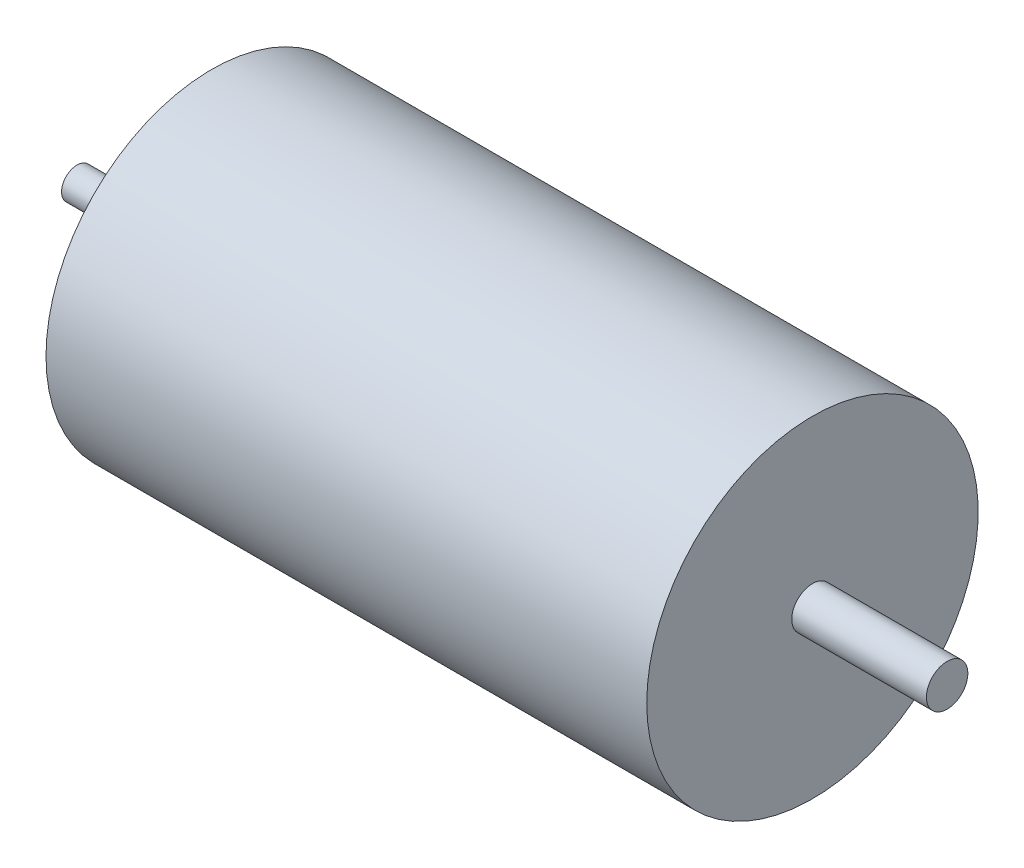
ISO-10303-21;
HEADER;
FILE_DESCRIPTION(('STEP AP214'),'2;1');
FILE_NAME('part.step','',(''),(''),'','','');
FILE_SCHEMA(('AUTOMOTIVE_DESIGN { 1 0 10303 214 1 1 1 1 }'));
ENDSEC;
DATA;
#1=APPLICATION_CONTEXT('core data for automotive mechanical design processes');
#2=APPLICATION_PROTOCOL_DEFINITION('international standard','automotive_design',2000,#1);
#3=PRODUCT_CONTEXT('',#1,'mechanical');
#4=PRODUCT('Part','Part','',(#3));
#5=PRODUCT_RELATED_PRODUCT_CATEGORY('part','',(#4));
#6=PRODUCT_DEFINITION_FORMATION('','',#4);
#7=PRODUCT_DEFINITION_CONTEXT('part definition',#1,'design');
#8=PRODUCT_DEFINITION('design','',#6,#7);
#9=PRODUCT_DEFINITION_SHAPE('','',#8);
#10=(LENGTH_UNIT() NAMED_UNIT(*) SI_UNIT(.MILLI.,.METRE.));
#11=(NAMED_UNIT(*) PLANE_ANGLE_UNIT() SI_UNIT($,.RADIAN.));
#12=(NAMED_UNIT(*) SI_UNIT($,.STERADIAN.) SOLID_ANGLE_UNIT());
#13=UNCERTAINTY_MEASURE_WITH_UNIT(LENGTH_MEASURE(1.E-05),#10,'distance_accuracy_value','');
#14=(GEOMETRIC_REPRESENTATION_CONTEXT(3) GLOBAL_UNCERTAINTY_ASSIGNED_CONTEXT((#13)) GLOBAL_UNIT_ASSIGNED_CONTEXT((#10,
#11,#12)) REPRESENTATION_CONTEXT('',''));
#15=CARTESIAN_POINT('',(0.,0.,0.));
#16=DIRECTION('',(0.,0.,1.));
#17=DIRECTION('',(1.,0.,0.));
#18=AXIS2_PLACEMENT_3D('',#15,#16,#17);
#19=CARTESIAN_POINT('',(0.,6.5,0.));
#20=DIRECTION('',(1.,0.,0.));
#21=DIRECTION('',(0.,0.,-1.));
#22=AXIS2_PLACEMENT_3D('',#19,#20,#21);
#23=PLANE('',#22);
#24=CARTESIAN_POINT('',(0.,9.5,0.));
#25=DIRECTION('',(-1.,0.,0.));
#26=DIRECTION('',(0.,0.,1.));
#27=AXIS2_PLACEMENT_3D('',#24,#25,#26);
#28=CIRCLE('',#27,1.275);
#29=CARTESIAN_POINT('',(0.,9.5,1.275));
#30=VERTEX_POINT('',#29);
#31=EDGE_CURVE('E90',#30,#30,#28,.T.);
#32=ORIENTED_EDGE('',*,*,#31,.F.);
#33=EDGE_LOOP('',(#32));
#34=FACE_BOUND('',#33,.T.);
#35=CARTESIAN_POINT('',(0.,-4.75,-8.22724133595217));
#36=DIRECTION('',(-1.,0.,0.));
#37=DIRECTION('',(0.,0.,1.));
#38=AXIS2_PLACEMENT_3D('',#35,#36,#37);
#39=CIRCLE('',#38,1.275);
#40=CARTESIAN_POINT('',(0.,-4.75,-6.95224133595216));
#41=VERTEX_POINT('',#40);
#42=EDGE_CURVE('E83',#41,#41,#39,.T.);
#43=ORIENTED_EDGE('',*,*,#42,.F.);
#44=EDGE_LOOP('',(#43));
#45=FACE_BOUND('',#44,.T.);
#46=CARTESIAN_POINT('',(0.,-4.75,8.22724133595217));
#47=DIRECTION('',(-1.,0.,0.));
#48=DIRECTION('',(0.,0.,1.));
#49=AXIS2_PLACEMENT_3D('',#46,#47,#48);
#50=CIRCLE('',#49,1.275);
#51=CARTESIAN_POINT('',(0.,-4.75,9.50224133595217));
#52=VERTEX_POINT('',#51);
#53=EDGE_CURVE('E99',#52,#52,#50,.T.);
#54=ORIENTED_EDGE('',*,*,#53,.F.);
#55=EDGE_LOOP('',(#54));
#56=FACE_BOUND('',#55,.T.);
#57=CARTESIAN_POINT('',(0.,-9.5,0.));
#58=DIRECTION('',(-1.,0.,0.));
#59=DIRECTION('',(0.,0.,1.));
#60=AXIS2_PLACEMENT_3D('',#57,#58,#59);
#61=CIRCLE('',#60,1.275);
#62=CARTESIAN_POINT('',(0.,-9.5,1.275));
#63=VERTEX_POINT('',#62);
#64=EDGE_CURVE('E108',#63,#63,#61,.T.);
#65=ORIENTED_EDGE('',*,*,#64,.F.);
#66=EDGE_LOOP('',(#65));
#67=FACE_BOUND('',#66,.T.);
#68=CARTESIAN_POINT('',(0.,0.,0.));
#69=DIRECTION('',(-1.,0.,0.));
#70=DIRECTION('',(0.,0.,1.));
#71=AXIS2_PLACEMENT_3D('',#68,#69,#70);
#72=CIRCLE('',#71,6.5);
#73=CARTESIAN_POINT('',(0.,0.,6.5));
#74=VERTEX_POINT('',#73);
#75=EDGE_CURVE('E117',#74,#74,#72,.T.);
#76=ORIENTED_EDGE('',*,*,#75,.F.);
#77=EDGE_LOOP('',(#76));
#78=FACE_BOUND('',#77,.T.);
#79=CARTESIAN_POINT('',(0.,0.,0.));
#80=DIRECTION('',(-1.,0.,0.));
#81=DIRECTION('',(0.,0.,1.));
#82=AXIS2_PLACEMENT_3D('',#79,#80,#81);
#83=CIRCLE('',#82,16.);
#84=CARTESIAN_POINT('',(0.,0.,16.));
#85=VERTEX_POINT('',#84);
#86=EDGE_CURVE('E13',#85,#85,#83,.T.);
#87=ORIENTED_EDGE('',*,*,#86,.T.);
#88=EDGE_LOOP('',(#87));
#89=FACE_BOUND('',#88,.T.);
#90=ADVANCED_FACE('F53',(#34,#45,#56,#67,#78,#89),#23,.F.);
#91=CARTESIAN_POINT('',(-42.4703832752613,0.,0.));
#92=DIRECTION('',(-1.,0.,0.));
#93=DIRECTION('',(0.,0.,1.));
#94=AXIS2_PLACEMENT_3D('',#91,#92,#93);
#95=CYLINDRICAL_SURFACE('',#94,16.);
#96=ORIENTED_EDGE('',*,*,#86,.F.);
#97=EDGE_LOOP('',(#96));
#98=FACE_BOUND('',#97,.T.);
#99=CARTESIAN_POINT('',(58.,0.,0.));
#100=DIRECTION('',(-1.,0.,0.));
#101=DIRECTION('',(0.,0.,1.));
#102=AXIS2_PLACEMENT_3D('',#99,#100,#101);
#103=CIRCLE('',#102,16.);
#104=CARTESIAN_POINT('',(58.,0.,16.));
#105=VERTEX_POINT('',#104);
#106=EDGE_CURVE('E60',#105,#105,#103,.T.);
#107=ORIENTED_EDGE('',*,*,#106,.T.);
#108=EDGE_LOOP('',(#107));
#109=FACE_BOUND('',#108,.T.);
#110=ADVANCED_FACE('F137',(#98,#109),#95,.T.);
#111=CARTESIAN_POINT('',(58.,16.,0.));
#112=DIRECTION('',(-1.,0.,0.));
#113=DIRECTION('',(0.,0.,1.));
#114=AXIS2_PLACEMENT_3D('',#111,#112,#113);
#115=PLANE('',#114);
#116=ORIENTED_EDGE('',*,*,#106,.F.);
#117=EDGE_LOOP('',(#116));
#118=FACE_BOUND('',#117,.T.);
#119=CARTESIAN_POINT('',(58.,0.,0.));
#120=DIRECTION('',(-1.,0.,0.));
#121=DIRECTION('',(0.,0.,1.));
#122=AXIS2_PLACEMENT_3D('',#119,#120,#121);
#123=CIRCLE('',#122,2.);
#124=CARTESIAN_POINT('',(58.,0.,2.));
#125=VERTEX_POINT('',#124);
#126=EDGE_CURVE('E132',#125,#125,#123,.T.);
#127=ORIENTED_EDGE('',*,*,#126,.T.);
#128=EDGE_LOOP('',(#127));
#129=FACE_BOUND('',#128,.T.);
#130=ADVANCED_FACE('F139',(#118,#129),#115,.F.);
#131=CARTESIAN_POINT('',(-42.4703832752613,0.,0.));
#132=DIRECTION('',(-1.,0.,0.));
#133=DIRECTION('',(0.,0.,1.));
#134=AXIS2_PLACEMENT_3D('',#131,#132,#133);
#135=CYLINDRICAL_SURFACE('',#134,2.);
#136=ORIENTED_EDGE('',*,*,#126,.F.);
#137=EDGE_LOOP('',(#136));
#138=FACE_BOUND('',#137,.T.);
#139=CARTESIAN_POINT('',(71.,0.,0.));
#140=DIRECTION('',(-1.,0.,0.));
#141=DIRECTION('',(0.,0.,1.));
#142=AXIS2_PLACEMENT_3D('',#139,#140,#141);
#143=CIRCLE('',#142,2.);
#144=CARTESIAN_POINT('',(71.,0.,2.));
#145=VERTEX_POINT('',#144);
#146=EDGE_CURVE('E129',#145,#145,#143,.T.);
#147=ORIENTED_EDGE('',*,*,#146,.T.);
#148=EDGE_LOOP('',(#147));
#149=FACE_BOUND('',#148,.T.);
#150=ADVANCED_FACE('F142',(#138,#149),#135,.T.);
#151=CARTESIAN_POINT('',(71.,2.,0.));
#152=DIRECTION('',(-1.,0.,0.));
#153=DIRECTION('',(0.,0.,1.));
#154=AXIS2_PLACEMENT_3D('',#151,#152,#153);
#155=PLANE('',#154);
#156=ORIENTED_EDGE('',*,*,#146,.F.);
#157=EDGE_LOOP('',(#156));
#158=FACE_BOUND('',#157,.T.);
#159=ADVANCED_FACE('F148',(#158),#155,.F.);
#160=CARTESIAN_POINT('',(-13.,0.,0.));
#161=DIRECTION('',(1.,0.,0.));
#162=DIRECTION('',(0.,0.,-1.));
#163=AXIS2_PLACEMENT_3D('',#160,#161,#162);
#164=PLANE('',#163);
#165=CARTESIAN_POINT('',(-13.,0.,0.));
#166=DIRECTION('',(-1.,0.,0.));
#167=DIRECTION('',(0.,0.,1.));
#168=AXIS2_PLACEMENT_3D('',#165,#166,#167);
#169=CIRCLE('',#168,1.5);
#170=CARTESIAN_POINT('',(-13.,0.,1.5));
#171=VERTEX_POINT('',#170);
#172=EDGE_CURVE('E126',#171,#171,#169,.T.);
#173=ORIENTED_EDGE('',*,*,#172,.T.);
#174=EDGE_LOOP('',(#173));
#175=FACE_BOUND('',#174,.T.);
#176=ADVANCED_FACE('F153',(#175),#164,.F.);
#177=CARTESIAN_POINT('',(-42.4703832752613,0.,0.));
#178=DIRECTION('',(-1.,0.,0.));
#179=DIRECTION('',(0.,0.,1.));
#180=AXIS2_PLACEMENT_3D('',#177,#178,#179);
#181=CYLINDRICAL_SURFACE('',#180,1.5);
#182=ORIENTED_EDGE('',*,*,#172,.F.);
#183=EDGE_LOOP('',(#182));
#184=FACE_BOUND('',#183,.T.);
#185=CARTESIAN_POINT('',(-3.,0.,0.));
#186=DIRECTION('',(-1.,0.,0.));
#187=DIRECTION('',(0.,0.,1.));
#188=AXIS2_PLACEMENT_3D('',#185,#186,#187);
#189=CIRCLE('',#188,1.5);
#190=CARTESIAN_POINT('',(-3.,0.,1.5));
#191=VERTEX_POINT('',#190);
#192=EDGE_CURVE('E123',#191,#191,#189,.T.);
#193=ORIENTED_EDGE('',*,*,#192,.T.);
#194=EDGE_LOOP('',(#193));
#195=FACE_BOUND('',#194,.T.);
#196=ADVANCED_FACE('F158',(#184,#195),#181,.T.);
#197=CARTESIAN_POINT('',(-3.,1.5,0.));
#198=DIRECTION('',(1.,0.,0.));
#199=DIRECTION('',(0.,0.,-1.));
#200=AXIS2_PLACEMENT_3D('',#197,#198,#199);
#201=PLANE('',#200);
#202=ORIENTED_EDGE('',*,*,#192,.F.);
#203=EDGE_LOOP('',(#202));
#204=FACE_BOUND('',#203,.T.);
#205=CARTESIAN_POINT('',(-3.,0.,0.));
#206=DIRECTION('',(-1.,0.,0.));
#207=DIRECTION('',(0.,0.,1.));
#208=AXIS2_PLACEMENT_3D('',#205,#206,#207);
#209=CIRCLE('',#208,6.5);
#210=CARTESIAN_POINT('',(-3.,0.,6.5));
#211=VERTEX_POINT('',#210);
#212=EDGE_CURVE('E120',#211,#211,#209,.T.);
#213=ORIENTED_EDGE('',*,*,#212,.T.);
#214=EDGE_LOOP('',(#213));
#215=FACE_BOUND('',#214,.T.);
#216=ADVANCED_FACE('F183',(#204,#215),#201,.F.);
#217=CARTESIAN_POINT('',(-42.4703832752613,0.,0.));
#218=DIRECTION('',(-1.,0.,0.));
#219=DIRECTION('',(0.,0.,1.));
#220=AXIS2_PLACEMENT_3D('',#217,#218,#219);
#221=CYLINDRICAL_SURFACE('',#220,6.5);
#222=ORIENTED_EDGE('',*,*,#212,.F.);
#223=EDGE_LOOP('',(#222));
#224=FACE_BOUND('',#223,.T.);
#225=ORIENTED_EDGE('',*,*,#75,.T.);
#226=EDGE_LOOP('',(#225));
#227=FACE_BOUND('',#226,.T.);
#228=ADVANCED_FACE('F180',(#224,#227),#221,.T.);
#229=CARTESIAN_POINT('',(7.25,-9.5,0.));
#230=DIRECTION('',(-1.,0.,0.));
#231=DIRECTION('',(0.,0.,1.));
#232=AXIS2_PLACEMENT_3D('',#229,#230,#231);
#233=CONICAL_SURFACE('',#232,1.025,1.02974425867665);
#234=CARTESIAN_POINT('',(7.86588213450325,-9.5,0.));
#235=VERTEX_POINT('',#234);
#236=VERTEX_LOOP('',#235);
#237=FACE_BOUND('',#236,.T.);
#238=CARTESIAN_POINT('',(7.25,-9.5,0.));
#239=DIRECTION('',(-1.,0.,0.));
#240=DIRECTION('',(0.,0.,1.));
#241=AXIS2_PLACEMENT_3D('',#238,#239,#240);
#242=CIRCLE('',#241,1.025);
#243=CARTESIAN_POINT('',(7.25,-9.5,1.025));
#244=VERTEX_POINT('',#243);
#245=EDGE_CURVE('E114',#244,#244,#242,.T.);
#246=ORIENTED_EDGE('',*,*,#245,.T.);
#247=EDGE_LOOP('',(#246));
#248=FACE_BOUND('',#247,.T.);
#249=ADVANCED_FACE('F182',(#237,#248),#233,.F.);
#250=CARTESIAN_POINT('',(0.,-9.5,0.));
#251=DIRECTION('',(-1.,0.,0.));
#252=DIRECTION('',(0.,0.,1.));
#253=AXIS2_PLACEMENT_3D('',#250,#251,#252);
#254=CYLINDRICAL_SURFACE('',#253,1.025);
#255=ORIENTED_EDGE('',*,*,#245,.F.);
#256=EDGE_LOOP('',(#255));
#257=FACE_BOUND('',#256,.T.);
#258=CARTESIAN_POINT('',(0.25,-9.5,0.));
#259=DIRECTION('',(-1.,0.,0.));
#260=DIRECTION('',(0.,0.,1.));
#261=AXIS2_PLACEMENT_3D('',#258,#259,#260);
#262=CIRCLE('',#261,1.025);
#263=CARTESIAN_POINT('',(0.25,-9.5,1.025));
#264=VERTEX_POINT('',#263);
#265=EDGE_CURVE('E111',#264,#264,#262,.T.);
#266=ORIENTED_EDGE('',*,*,#265,.T.);
#267=EDGE_LOOP('',(#266));
#268=FACE_BOUND('',#267,.T.);
#269=ADVANCED_FACE('F190',(#257,#268),#254,.F.);
#270=CARTESIAN_POINT('',(0.,-9.5,0.));
#271=DIRECTION('',(-1.,0.,0.));
#272=DIRECTION('',(0.,0.,1.));
#273=AXIS2_PLACEMENT_3D('',#270,#271,#272);
#274=CONICAL_SURFACE('',#273,1.275,0.785398163397448);
#275=ORIENTED_EDGE('',*,*,#265,.F.);
#276=EDGE_LOOP('',(#275));
#277=FACE_BOUND('',#276,.T.);
#278=ORIENTED_EDGE('',*,*,#64,.T.);
#279=EDGE_LOOP('',(#278));
#280=FACE_BOUND('',#279,.T.);
#281=ADVANCED_FACE('F236',(#277,#280),#274,.F.);
#282=CARTESIAN_POINT('',(7.25,-4.75,8.22724133595217));
#283=DIRECTION('',(-1.,0.,0.));
#284=DIRECTION('',(0.,0.,1.));
#285=AXIS2_PLACEMENT_3D('',#282,#283,#284);
#286=CONICAL_SURFACE('',#285,1.025,1.02974425867665);
#287=CARTESIAN_POINT('',(7.86588213450325,-4.75,8.22724133595217));
#288=VERTEX_POINT('',#287);
#289=VERTEX_LOOP('',#288);
#290=FACE_BOUND('',#289,.T.);
#291=CARTESIAN_POINT('',(7.25,-4.75,8.22724133595217));
#292=DIRECTION('',(-1.,0.,0.));
#293=DIRECTION('',(0.,0.,1.));
#294=AXIS2_PLACEMENT_3D('',#291,#292,#293);
#295=CIRCLE('',#294,1.025);
#296=CARTESIAN_POINT('',(7.25,-4.75,9.25224133595217));
#297=VERTEX_POINT('',#296);
#298=EDGE_CURVE('E105',#297,#297,#295,.T.);
#299=ORIENTED_EDGE('',*,*,#298,.T.);
#300=EDGE_LOOP('',(#299));
#301=FACE_BOUND('',#300,.T.);
#302=ADVANCED_FACE('F247',(#290,#301),#286,.F.);
#303=CARTESIAN_POINT('',(0.,-4.75,8.22724133595217));
#304=DIRECTION('',(-1.,0.,0.));
#305=DIRECTION('',(0.,0.,1.));
#306=AXIS2_PLACEMENT_3D('',#303,#304,#305);
#307=CYLINDRICAL_SURFACE('',#306,1.025);
#308=ORIENTED_EDGE('',*,*,#298,.F.);
#309=EDGE_LOOP('',(#308));
#310=FACE_BOUND('',#309,.T.);
#311=CARTESIAN_POINT('',(0.25,-4.75,8.22724133595217));
#312=DIRECTION('',(-1.,0.,0.));
#313=DIRECTION('',(0.,0.,1.));
#314=AXIS2_PLACEMENT_3D('',#311,#312,#313);
#315=CIRCLE('',#314,1.025);
#316=CARTESIAN_POINT('',(0.25,-4.75,9.25224133595217));
#317=VERTEX_POINT('',#316);
#318=EDGE_CURVE('E102',#317,#317,#315,.T.);
#319=ORIENTED_EDGE('',*,*,#318,.T.);
#320=EDGE_LOOP('',(#319));
#321=FACE_BOUND('',#320,.T.);
#322=ADVANCED_FACE('F257',(#310,#321),#307,.F.);
#323=CARTESIAN_POINT('',(0.,-4.75,8.22724133595217));
#324=DIRECTION('',(-1.,0.,0.));
#325=DIRECTION('',(0.,0.,1.));
#326=AXIS2_PLACEMENT_3D('',#323,#324,#325);
#327=CONICAL_SURFACE('',#326,1.275,0.78539816339745);
#328=ORIENTED_EDGE('',*,*,#318,.F.);
#329=EDGE_LOOP('',(#328));
#330=FACE_BOUND('',#329,.T.);
#331=ORIENTED_EDGE('',*,*,#53,.T.);
#332=EDGE_LOOP('',(#331));
#333=FACE_BOUND('',#332,.T.);
#334=ADVANCED_FACE('F266',(#330,#333),#327,.F.);
#335=CARTESIAN_POINT('',(7.25,-4.75,-8.22724133595217));
#336=DIRECTION('',(-1.,0.,0.));
#337=DIRECTION('',(0.,0.,1.));
#338=AXIS2_PLACEMENT_3D('',#335,#336,#337);
#339=CONICAL_SURFACE('',#338,1.025,1.02974425867665);
#340=CARTESIAN_POINT('',(7.86588213450325,-4.75,-8.22724133595217));
#341=VERTEX_POINT('',#340);
#342=VERTEX_LOOP('',#341);
#343=FACE_BOUND('',#342,.T.);
#344=CARTESIAN_POINT('',(7.25,-4.75,-8.22724133595217));
#345=DIRECTION('',(-1.,0.,0.));
#346=DIRECTION('',(0.,0.,1.));
#347=AXIS2_PLACEMENT_3D('',#344,#345,#346);
#348=CIRCLE('',#347,1.025);
#349=CARTESIAN_POINT('',(7.25,-4.75,-7.20224133595217));
#350=VERTEX_POINT('',#349);
#351=EDGE_CURVE('E96',#350,#350,#348,.T.);
#352=ORIENTED_EDGE('',*,*,#351,.T.);
#353=EDGE_LOOP('',(#352));
#354=FACE_BOUND('',#353,.T.);
#355=ADVANCED_FACE('F278',(#343,#354),#339,.F.);
#356=CARTESIAN_POINT('',(0.,-4.75,-8.22724133595217));
#357=DIRECTION('',(-1.,0.,0.));
#358=DIRECTION('',(0.,0.,1.));
#359=AXIS2_PLACEMENT_3D('',#356,#357,#358);
#360=CYLINDRICAL_SURFACE('',#359,1.025);
#361=ORIENTED_EDGE('',*,*,#351,.F.);
#362=EDGE_LOOP('',(#361));
#363=FACE_BOUND('',#362,.T.);
#364=CARTESIAN_POINT('',(0.25,-4.75,-8.22724133595217));
#365=DIRECTION('',(-1.,0.,0.));
#366=DIRECTION('',(0.,0.,1.));
#367=AXIS2_PLACEMENT_3D('',#364,#365,#366);
#368=CIRCLE('',#367,1.025);
#369=CARTESIAN_POINT('',(0.25,-4.75,-7.20224133595217));
#370=VERTEX_POINT('',#369);
#371=EDGE_CURVE('E87',#370,#370,#368,.T.);
#372=ORIENTED_EDGE('',*,*,#371,.T.);
#373=EDGE_LOOP('',(#372));
#374=FACE_BOUND('',#373,.T.);
#375=ADVANCED_FACE('F288',(#363,#374),#360,.F.);
#376=CARTESIAN_POINT('',(0.,-4.75,-8.22724133595217));
#377=DIRECTION('',(-1.,0.,0.));
#378=DIRECTION('',(0.,0.,1.));
#379=AXIS2_PLACEMENT_3D('',#376,#377,#378);
#380=CONICAL_SURFACE('',#379,1.275,0.78539816339745);
#381=ORIENTED_EDGE('',*,*,#371,.F.);
#382=EDGE_LOOP('',(#381));
#383=FACE_BOUND('',#382,.T.);
#384=ORIENTED_EDGE('',*,*,#42,.T.);
#385=EDGE_LOOP('',(#384));
#386=FACE_BOUND('',#385,.T.);
#387=ADVANCED_FACE('F77',(#383,#386),#380,.F.);
#388=CARTESIAN_POINT('',(7.25,9.5,0.));
#389=DIRECTION('',(-1.,0.,0.));
#390=DIRECTION('',(0.,0.,1.));
#391=AXIS2_PLACEMENT_3D('',#388,#389,#390);
#392=CONICAL_SURFACE('',#391,1.025,1.02974425867665);
#393=CARTESIAN_POINT('',(7.86588213450325,9.5,0.));
#394=VERTEX_POINT('',#393);
#395=VERTEX_LOOP('',#394);
#396=FACE_BOUND('',#395,.T.);
#397=CARTESIAN_POINT('',(7.25,9.5,0.));
#398=DIRECTION('',(-1.,0.,0.));
#399=DIRECTION('',(0.,0.,1.));
#400=AXIS2_PLACEMENT_3D('',#397,#398,#399);
#401=CIRCLE('',#400,1.025);
#402=CARTESIAN_POINT('',(7.25,9.5,1.025));
#403=VERTEX_POINT('',#402);
#404=EDGE_CURVE('E81',#403,#403,#401,.T.);
#405=ORIENTED_EDGE('',*,*,#404,.T.);
#406=EDGE_LOOP('',(#405));
#407=FACE_BOUND('',#406,.T.);
#408=ADVANCED_FACE('F73',(#396,#407),#392,.F.);
#409=CARTESIAN_POINT('',(0.,9.5,0.));
#410=DIRECTION('',(-1.,0.,0.));
#411=DIRECTION('',(0.,0.,1.));
#412=AXIS2_PLACEMENT_3D('',#409,#410,#411);
#413=CYLINDRICAL_SURFACE('',#412,1.025);
#414=ORIENTED_EDGE('',*,*,#404,.F.);
#415=EDGE_LOOP('',(#414));
#416=FACE_BOUND('',#415,.T.);
#417=CARTESIAN_POINT('',(0.25,9.5,0.));
#418=DIRECTION('',(-1.,0.,0.));
#419=DIRECTION('',(0.,0.,1.));
#420=AXIS2_PLACEMENT_3D('',#417,#418,#419);
#421=CIRCLE('',#420,1.025);
#422=CARTESIAN_POINT('',(0.25,9.5,1.025));
#423=VERTEX_POINT('',#422);
#424=EDGE_CURVE('E84',#423,#423,#421,.T.);
#425=ORIENTED_EDGE('',*,*,#424,.T.);
#426=EDGE_LOOP('',(#425));
#427=FACE_BOUND('',#426,.T.);
#428=ADVANCED_FACE('F76',(#416,#427),#413,.F.);
#429=CARTESIAN_POINT('',(0.,9.5,0.));
#430=DIRECTION('',(-1.,0.,0.));
#431=DIRECTION('',(0.,0.,1.));
#432=AXIS2_PLACEMENT_3D('',#429,#430,#431);
#433=CONICAL_SURFACE('',#432,1.275,0.785398163397448);
#434=ORIENTED_EDGE('',*,*,#424,.F.);
#435=EDGE_LOOP('',(#434));
#436=FACE_BOUND('',#435,.T.);
#437=ORIENTED_EDGE('',*,*,#31,.T.);
#438=EDGE_LOOP('',(#437));
#439=FACE_BOUND('',#438,.T.);
#440=ADVANCED_FACE('F324',(#436,#439),#433,.F.);
#441=CLOSED_SHELL('',(#90,#110,#130,#150,#159,#176,#196,#216,#228,#249,#269,#281,#302,#322,#334,
#355,#375,#387,#408,#428,#440));
#442=MANIFOLD_SOLID_BREP('B2',#441);
#443=ADVANCED_BREP_SHAPE_REPRESENTATION('',(#18,#442),#14);
#444=SHAPE_DEFINITION_REPRESENTATION(#9,#443);
ENDSEC;
END-ISO-10303-21;
